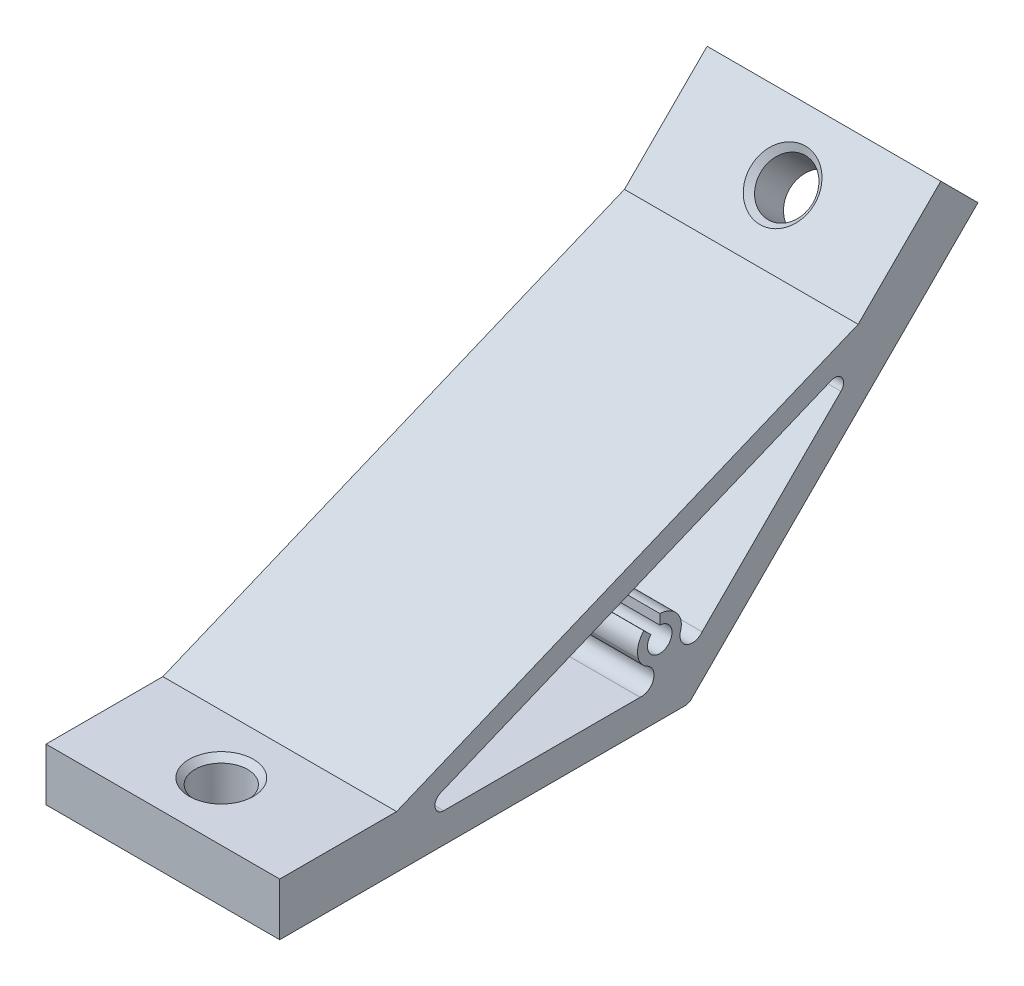
ISO-10303-21;
HEADER;
FILE_DESCRIPTION(('STEP AP214'),'2;1');
FILE_NAME('part.step','',(''),(''),'','','');
FILE_SCHEMA(('AUTOMOTIVE_DESIGN { 1 0 10303 214 1 1 1 1 }'));
ENDSEC;
DATA;
#1=APPLICATION_CONTEXT('core data for automotive mechanical design processes');
#2=APPLICATION_PROTOCOL_DEFINITION('international standard','automotive_design',2000,#1);
#3=PRODUCT_CONTEXT('',#1,'mechanical');
#4=PRODUCT('Part','Part','',(#3));
#5=PRODUCT_RELATED_PRODUCT_CATEGORY('part','',(#4));
#6=PRODUCT_DEFINITION_FORMATION('','',#4);
#7=PRODUCT_DEFINITION_CONTEXT('part definition',#1,'design');
#8=PRODUCT_DEFINITION('design','',#6,#7);
#9=PRODUCT_DEFINITION_SHAPE('','',#8);
#10=(LENGTH_UNIT() NAMED_UNIT(*) SI_UNIT(.MILLI.,.METRE.));
#11=(NAMED_UNIT(*) PLANE_ANGLE_UNIT() SI_UNIT($,.RADIAN.));
#12=(NAMED_UNIT(*) SI_UNIT($,.STERADIAN.) SOLID_ANGLE_UNIT());
#13=UNCERTAINTY_MEASURE_WITH_UNIT(LENGTH_MEASURE(1.E-05),#10,'distance_accuracy_value','');
#14=(GEOMETRIC_REPRESENTATION_CONTEXT(3) GLOBAL_UNCERTAINTY_ASSIGNED_CONTEXT((#13)) GLOBAL_UNIT_ASSIGNED_CONTEXT((#10,
#11,#12)) REPRESENTATION_CONTEXT('',''));
#15=CARTESIAN_POINT('',(0.,0.,0.));
#16=DIRECTION('',(0.,0.,1.));
#17=DIRECTION('',(1.,0.,0.));
#18=AXIS2_PLACEMENT_3D('',#15,#16,#17);
#19=CARTESIAN_POINT('',(20.,9.,70.));
#20=DIRECTION('',(0.,0.,-1.));
#21=DIRECTION('',(-1.,0.,0.));
#22=AXIS2_PLACEMENT_3D('',#19,#20,#21);
#23=PLANE('',#22);
#24=DIRECTION('',(0.,-1.,0.));
#25=VECTOR('',#24,1.);
#26=CARTESIAN_POINT('',(-20.,9.,70.));
#27=LINE('',#26,#25);
#28=CARTESIAN_POINT('',(-20.,9.,70.));
#29=VERTEX_POINT('',#28);
#30=CARTESIAN_POINT('',(-20.,0.,70.));
#31=VERTEX_POINT('',#30);
#32=EDGE_CURVE('E232',#29,#31,#27,.T.);
#33=ORIENTED_EDGE('',*,*,#32,.T.);
#34=DIRECTION('',(-1.,0.,0.));
#35=VECTOR('',#34,1.);
#36=CARTESIAN_POINT('',(20.,0.,70.));
#37=LINE('',#36,#35);
#38=CARTESIAN_POINT('',(20.,0.,70.));
#39=VERTEX_POINT('',#38);
#40=EDGE_CURVE('E286',#39,#31,#37,.T.);
#41=ORIENTED_EDGE('',*,*,#40,.F.);
#42=DIRECTION('',(0.,-1.,0.));
#43=VECTOR('',#42,1.);
#44=CARTESIAN_POINT('',(20.,9.,70.));
#45=LINE('',#44,#43);
#46=CARTESIAN_POINT('',(20.,9.,70.));
#47=VERTEX_POINT('',#46);
#48=EDGE_CURVE('E240',#47,#39,#45,.T.);
#49=ORIENTED_EDGE('',*,*,#48,.F.);
#50=DIRECTION('',(-1.,0.,0.));
#51=VECTOR('',#50,1.);
#52=CARTESIAN_POINT('',(20.,9.,70.));
#53=LINE('',#52,#51);
#54=EDGE_CURVE('E257',#47,#29,#53,.T.);
#55=ORIENTED_EDGE('',*,*,#54,.T.);
#56=EDGE_LOOP('',(#33,#41,#49,#55));
#57=FACE_BOUND('',#56,.T.);
#58=ADVANCED_FACE('F16',(#57),#23,.F.);
#59=CARTESIAN_POINT('',(20.,0.,70.));
#60=DIRECTION('',(0.,1.,0.));
#61=DIRECTION('',(0.,0.,1.));
#62=AXIS2_PLACEMENT_3D('',#59,#60,#61);
#63=PLANE('',#62);
#64=CARTESIAN_POINT('',(0.,0.,60.));
#65=DIRECTION('',(0.,1.,0.));
#66=DIRECTION('',(0.,0.,1.));
#67=AXIS2_PLACEMENT_3D('',#64,#65,#66);
#68=CIRCLE('',#67,5.50000000000003);
#69=CARTESIAN_POINT('',(0.,0.,65.5));
#70=VERTEX_POINT('',#69);
#71=EDGE_CURVE('E307',#70,#70,#68,.T.);
#72=ORIENTED_EDGE('',*,*,#71,.T.);
#73=EDGE_LOOP('',(#72));
#74=FACE_BOUND('',#73,.T.);
#75=DIRECTION('',(0.,0.,-1.));
#76=VECTOR('',#75,1.);
#77=CARTESIAN_POINT('',(-20.,0.,70.));
#78=LINE('',#77,#76);
#79=CARTESIAN_POINT('',(-20.,0.,0.621320343559648));
#80=VERTEX_POINT('',#79);
#81=EDGE_CURVE('E260',#31,#80,#78,.T.);
#82=ORIENTED_EDGE('',*,*,#81,.T.);
#83=DIRECTION('',(-1.,0.,0.));
#84=VECTOR('',#83,1.);
#85=CARTESIAN_POINT('',(20.,0.,0.621320343559648));
#86=LINE('',#85,#84);
#87=CARTESIAN_POINT('',(20.,0.,0.621320343559648));
#88=VERTEX_POINT('',#87);
#89=EDGE_CURVE('E336',#80,#88,#86,.F.);
#90=ORIENTED_EDGE('',*,*,#89,.T.);
#91=DIRECTION('',(0.,0.,-1.));
#92=VECTOR('',#91,1.);
#93=CARTESIAN_POINT('',(20.,0.,70.));
#94=LINE('',#93,#92);
#95=EDGE_CURVE('E243',#39,#88,#94,.T.);
#96=ORIENTED_EDGE('',*,*,#95,.F.);
#97=ORIENTED_EDGE('',*,*,#40,.T.);
#98=EDGE_LOOP('',(#82,#90,#96,#97));
#99=FACE_BOUND('',#98,.T.);
#100=ADVANCED_FACE('F411',(#74,#99),#63,.F.);
#101=CARTESIAN_POINT('',(20.,0.,0.));
#102=DIRECTION('',(0.,0.707106781186546,0.707106781186549));
#103=DIRECTION('',(0.,-0.707106781186549,0.707106781186546));
#104=AXIS2_PLACEMENT_3D('',#101,#102,#103);
#105=PLANE('',#104);
#106=CARTESIAN_POINT('',(0.,42.4264068711929,-42.4264068711928));
#107=DIRECTION('',(0.,0.707106781186546,0.707106781186549));
#108=DIRECTION('',(0.,-0.707106781186549,0.707106781186546));
#109=AXIS2_PLACEMENT_3D('',#106,#107,#108);
#110=CIRCLE('',#109,5.50000000000001);
#111=CARTESIAN_POINT('',(0.,38.5373195746669,-38.5373195746668));
#112=VERTEX_POINT('',#111);
#113=EDGE_CURVE('E316',#112,#112,#110,.T.);
#114=ORIENTED_EDGE('',*,*,#113,.T.);
#115=EDGE_LOOP('',(#114));
#116=FACE_BOUND('',#115,.T.);
#117=DIRECTION('',(0.,0.707106781186549,-0.707106781186546));
#118=VECTOR('',#117,1.);
#119=CARTESIAN_POINT('',(20.,0.,0.));
#120=LINE('',#119,#118);
#121=CARTESIAN_POINT('',(20.,0.43933982822018,-0.439339828220179));
#122=VERTEX_POINT('',#121);
#123=CARTESIAN_POINT('',(20.,49.4974746830584,-49.4974746830582));
#124=VERTEX_POINT('',#123);
#125=EDGE_CURVE('E247',#122,#124,#120,.T.);
#126=ORIENTED_EDGE('',*,*,#125,.F.);
#127=DIRECTION('',(-1.,0.,0.));
#128=VECTOR('',#127,1.);
#129=CARTESIAN_POINT('',(20.,0.43933982822018,-0.439339828220179));
#130=LINE('',#129,#128);
#131=CARTESIAN_POINT('',(-20.,0.43933982822018,-0.439339828220179));
#132=VERTEX_POINT('',#131);
#133=EDGE_CURVE('E331',#122,#132,#130,.T.);
#134=ORIENTED_EDGE('',*,*,#133,.T.);
#135=DIRECTION('',(0.,0.707106781186549,-0.707106781186546));
#136=VECTOR('',#135,1.);
#137=CARTESIAN_POINT('',(-20.,0.,0.));
#138=LINE('',#137,#136);
#139=CARTESIAN_POINT('',(-20.,49.4974746830584,-49.4974746830582));
#140=VERTEX_POINT('',#139);
#141=EDGE_CURVE('E263',#132,#140,#138,.T.);
#142=ORIENTED_EDGE('',*,*,#141,.T.);
#143=DIRECTION('',(-1.,0.,0.));
#144=VECTOR('',#143,1.);
#145=CARTESIAN_POINT('',(20.,49.4974746830584,-49.4974746830582));
#146=LINE('',#145,#144);
#147=EDGE_CURVE('E283',#124,#140,#146,.T.);
#148=ORIENTED_EDGE('',*,*,#147,.F.);
#149=EDGE_LOOP('',(#126,#134,#142,#148));
#150=FACE_BOUND('',#149,.T.);
#151=ADVANCED_FACE('F417',(#116,#150),#105,.F.);
#152=CARTESIAN_POINT('',(20.,49.4974746830584,-49.4974746830582));
#153=DIRECTION('',(0.,-0.707106781186549,0.707106781186546));
#154=DIRECTION('',(0.,-0.707106781186546,-0.707106781186549));
#155=AXIS2_PLACEMENT_3D('',#152,#153,#154);
#156=PLANE('',#155);
#157=DIRECTION('',(0.,0.707106781186546,0.707106781186549));
#158=VECTOR('',#157,1.);
#159=CARTESIAN_POINT('',(-20.,49.4974746830584,-49.4974746830582));
#160=LINE('',#159,#158);
#161=CARTESIAN_POINT('',(-20.,55.8614357137373,-43.1335136523793));
#162=VERTEX_POINT('',#161);
#163=EDGE_CURVE('E265',#140,#162,#160,.T.);
#164=ORIENTED_EDGE('',*,*,#163,.T.);
#165=DIRECTION('',(-1.,0.,0.));
#166=VECTOR('',#165,1.);
#167=CARTESIAN_POINT('',(20.,55.8614357137373,-43.1335136523793));
#168=LINE('',#167,#166);
#169=CARTESIAN_POINT('',(20.,55.8614357137373,-43.1335136523793));
#170=VERTEX_POINT('',#169);
#171=EDGE_CURVE('E280',#170,#162,#168,.T.);
#172=ORIENTED_EDGE('',*,*,#171,.F.);
#173=DIRECTION('',(0.,0.707106781186546,0.707106781186549));
#174=VECTOR('',#173,1.);
#175=CARTESIAN_POINT('',(20.,49.4974746830584,-49.4974746830582));
#176=LINE('',#175,#174);
#177=EDGE_CURVE('E249',#124,#170,#176,.T.);
#178=ORIENTED_EDGE('',*,*,#177,.F.);
#179=ORIENTED_EDGE('',*,*,#147,.T.);
#180=EDGE_LOOP('',(#164,#172,#178,#179));
#181=FACE_BOUND('',#180,.T.);
#182=ADVANCED_FACE('F459',(#181),#156,.F.);
#183=CARTESIAN_POINT('',(20.,55.8614357137373,-43.1335136523793));
#184=DIRECTION('',(0.,-0.707106781186546,-0.707106781186549));
#185=DIRECTION('',(0.,0.707106781186549,-0.707106781186546));
#186=AXIS2_PLACEMENT_3D('',#183,#184,#185);
#187=PLANE('',#186);
#188=CARTESIAN_POINT('',(0.,48.7903679018718,-36.0624458405138));
#189=DIRECTION('',(0.,-0.707106781186546,-0.707106781186549));
#190=DIRECTION('',(0.,0.707106781186549,-0.707106781186546));
#191=AXIS2_PLACEMENT_3D('',#188,#189,#190);
#192=CIRCLE('',#191,5.5);
#193=CARTESIAN_POINT('',(0.,52.6794551983979,-39.9515331370398));
#194=VERTEX_POINT('',#193);
#195=EDGE_CURVE('E328',#194,#194,#192,.T.);
#196=ORIENTED_EDGE('',*,*,#195,.T.);
#197=EDGE_LOOP('',(#196));
#198=FACE_BOUND('',#197,.T.);
#199=DIRECTION('',(0.,-0.707106781186549,0.707106781186546));
#200=VECTOR('',#199,1.);
#201=CARTESIAN_POINT('',(-20.,55.8614357137373,-43.1335136523793));
#202=LINE('',#201,#200);
#203=CARTESIAN_POINT('',(-20.,41.7193000900063,-28.9913780286484));
#204=VERTEX_POINT('',#203);
#205=EDGE_CURVE('E267',#162,#204,#202,.T.);
#206=ORIENTED_EDGE('',*,*,#205,.T.);
#207=DIRECTION('',(-1.,0.,0.));
#208=VECTOR('',#207,1.);
#209=CARTESIAN_POINT('',(20.,41.7193000900063,-28.9913780286484));
#210=LINE('',#209,#208);
#211=CARTESIAN_POINT('',(20.,41.7193000900063,-28.9913780286484));
#212=VERTEX_POINT('',#211);
#213=EDGE_CURVE('E277',#212,#204,#210,.T.);
#214=ORIENTED_EDGE('',*,*,#213,.F.);
#215=DIRECTION('',(0.,-0.707106781186549,0.707106781186546));
#216=VECTOR('',#215,1.);
#217=CARTESIAN_POINT('',(20.,55.8614357137373,-43.1335136523793));
#218=LINE('',#217,#216);
#219=EDGE_CURVE('E251',#170,#212,#218,.T.);
#220=ORIENTED_EDGE('',*,*,#219,.F.);
#221=ORIENTED_EDGE('',*,*,#171,.T.);
#222=EDGE_LOOP('',(#206,#214,#220,#221));
#223=FACE_BOUND('',#222,.T.);
#224=ADVANCED_FACE('F465',(#198,#223),#187,.F.);
#225=CARTESIAN_POINT('',(20.,41.7193000900063,-28.9913780286484));
#226=DIRECTION('',(0.,-0.923879532511287,-0.382683432365091));
#227=DIRECTION('',(0.,0.382683432365091,-0.923879532511287));
#228=AXIS2_PLACEMENT_3D('',#225,#226,#227);
#229=PLANE('',#228);
#230=DIRECTION('',(0.,-0.382683432365091,0.923879532511287));
#231=VECTOR('',#230,1.);
#232=CARTESIAN_POINT('',(-20.,41.7193000900063,-28.9913780286484));
#233=LINE('',#232,#231);
#234=CARTESIAN_POINT('',(-20.,9.,50.));
#235=VERTEX_POINT('',#234);
#236=EDGE_CURVE('E269',#204,#235,#233,.T.);
#237=ORIENTED_EDGE('',*,*,#236,.T.);
#238=DIRECTION('',(-1.,0.,0.));
#239=VECTOR('',#238,1.);
#240=CARTESIAN_POINT('',(20.,9.,50.));
#241=LINE('',#240,#239);
#242=CARTESIAN_POINT('',(20.,9.,50.));
#243=VERTEX_POINT('',#242);
#244=EDGE_CURVE('E274',#243,#235,#241,.T.);
#245=ORIENTED_EDGE('',*,*,#244,.F.);
#246=DIRECTION('',(0.,-0.382683432365091,0.923879532511287));
#247=VECTOR('',#246,1.);
#248=CARTESIAN_POINT('',(20.,41.7193000900063,-28.9913780286484));
#249=LINE('',#248,#247);
#250=EDGE_CURVE('E253',#212,#243,#249,.T.);
#251=ORIENTED_EDGE('',*,*,#250,.F.);
#252=ORIENTED_EDGE('',*,*,#213,.T.);
#253=EDGE_LOOP('',(#237,#245,#251,#252));
#254=FACE_BOUND('',#253,.T.);
#255=ADVANCED_FACE('F469',(#254),#229,.F.);
#256=CARTESIAN_POINT('',(20.,9.,50.));
#257=DIRECTION('',(0.,-1.,0.));
#258=DIRECTION('',(0.,0.,-1.));
#259=AXIS2_PLACEMENT_3D('',#256,#257,#258);
#260=PLANE('',#259);
#261=CARTESIAN_POINT('',(0.,9.,60.));
#262=DIRECTION('',(0.,-1.,0.));
#263=DIRECTION('',(0.,0.,-1.));
#264=AXIS2_PLACEMENT_3D('',#261,#262,#263);
#265=CIRCLE('',#264,5.49999999999999);
#266=CARTESIAN_POINT('',(0.,9.,54.5));
#267=VERTEX_POINT('',#266);
#268=EDGE_CURVE('E325',#267,#267,#265,.T.);
#269=ORIENTED_EDGE('',*,*,#268,.T.);
#270=EDGE_LOOP('',(#269));
#271=FACE_BOUND('',#270,.T.);
#272=DIRECTION('',(0.,0.,1.));
#273=VECTOR('',#272,1.);
#274=CARTESIAN_POINT('',(-20.,9.,50.));
#275=LINE('',#274,#273);
#276=EDGE_CURVE('E244',#235,#29,#275,.T.);
#277=ORIENTED_EDGE('',*,*,#276,.T.);
#278=ORIENTED_EDGE('',*,*,#54,.F.);
#279=DIRECTION('',(0.,0.,1.));
#280=VECTOR('',#279,1.);
#281=CARTESIAN_POINT('',(20.,9.,50.));
#282=LINE('',#281,#280);
#283=EDGE_CURVE('E255',#243,#47,#282,.T.);
#284=ORIENTED_EDGE('',*,*,#283,.F.);
#285=ORIENTED_EDGE('',*,*,#244,.T.);
#286=EDGE_LOOP('',(#277,#278,#284,#285));
#287=FACE_BOUND('',#286,.T.);
#288=ADVANCED_FACE('F474',(#271,#287),#260,.F.);
#289=CARTESIAN_POINT('',(20.,0.,0.));
#290=DIRECTION('',(1.,0.,0.));
#291=DIRECTION('',(0.,0.,-1.));
#292=AXIS2_PLACEMENT_3D('',#289,#290,#291);
#293=PLANE('',#292);
#294=CARTESIAN_POINT('',(20.,10.8154070502541,-0.615215798921915));
#295=DIRECTION('',(1.,0.,0.));
#296=DIRECTION('',(0.,0.,-1.));
#297=AXIS2_PLACEMENT_3D('',#294,#295,#296);
#298=CIRCLE('',#297,2.12778789665589);
#299=CARTESIAN_POINT('',(20.,11.4653478220074,1.41087855385834));
#300=VERTEX_POINT('',#299);
#301=CARTESIAN_POINT('',(20.,9.50085947219855,-2.28837030409573));
#302=VERTEX_POINT('',#301);
#303=EDGE_CURVE('E223',#300,#302,#298,.T.);
#304=ORIENTED_EDGE('',*,*,#303,.F.);
#305=CARTESIAN_POINT('',(20.,12.3817090431255,4.26749930440101));
#306=DIRECTION('',(1.,0.,0.));
#307=DIRECTION('',(0.,0.,-1.));
#308=AXIS2_PLACEMENT_3D('',#305,#306,#307);
#309=CIRCLE('',#308,3.);
#310=CARTESIAN_POINT('',(20.,13.8131179548462,1.63101138911547));
#311=VERTEX_POINT('',#310);
#312=EDGE_CURVE('E345',#300,#311,#309,.T.);
#313=ORIENTED_EDGE('',*,*,#312,.T.);
#314=CARTESIAN_POINT('',(20.,12.,4.97056274847716));
#315=DIRECTION('',(-1.,0.,0.));
#316=DIRECTION('',(0.,0.,-1.));
#317=AXIS2_PLACEMENT_3D('',#314,#315,#316);
#318=CIRCLE('',#317,3.8);
#319=CARTESIAN_POINT('',(20.,15.7996748244009,4.92085129291301));
#320=VERTEX_POINT('',#319);
#321=EDGE_CURVE('E220',#320,#311,#318,.T.);
#322=ORIENTED_EDGE('',*,*,#321,.F.);
#323=DIRECTION('',(0.,0.99991442747391,-0.0130819619905629));
#324=VECTOR('',#323,1.);
#325=CARTESIAN_POINT('',(20.,15.7996748244009,4.92085129291301));
#326=LINE('',#325,#324);
#327=CARTESIAN_POINT('',(20.,14.0998202976952,4.94309062829697));
#328=VERTEX_POINT('',#327);
#329=EDGE_CURVE('E217',#328,#320,#326,.T.);
#330=ORIENTED_EDGE('',*,*,#329,.F.);
#331=CARTESIAN_POINT('',(20.,12.,4.97056274847716));
#332=DIRECTION('',(1.,0.,0.));
#333=DIRECTION('',(0.,0.,-1.));
#334=AXIS2_PLACEMENT_3D('',#331,#332,#333);
#335=CIRCLE('',#334,2.1);
#336=CARTESIAN_POINT('',(20.,13.4653714493005,6.47478564272358));
#337=VERTEX_POINT('',#336);
#338=EDGE_CURVE('E214',#337,#328,#335,.T.);
#339=ORIENTED_EDGE('',*,*,#338,.F.);
#340=DIRECTION('',(0.,-0.697795928238311,-0.716296616307821));
#341=VECTOR('',#340,1.);
#342=CARTESIAN_POINT('',(20.,14.6516245273056,7.69248989044687));
#343=LINE('',#342,#341);
#344=CARTESIAN_POINT('',(20.,14.6516245273056,7.69248989044687));
#345=VERTEX_POINT('',#344);
#346=EDGE_CURVE('E212',#345,#337,#343,.T.);
#347=ORIENTED_EDGE('',*,*,#346,.F.);
#348=CARTESIAN_POINT('',(20.,12.,4.97056274847716));
#349=DIRECTION('',(-1.,0.,0.));
#350=DIRECTION('',(0.,0.,-1.));
#351=AXIS2_PLACEMENT_3D('',#348,#349,#350);
#352=CIRCLE('',#351,3.8);
#353=CARTESIAN_POINT('',(20.,10.9206485886374,8.61405016176536));
#354=VERTEX_POINT('',#353);
#355=EDGE_CURVE('E180',#354,#345,#352,.T.);
#356=ORIENTED_EDGE('',*,*,#355,.F.);
#357=CARTESIAN_POINT('',(20.,11.7727681239237,5.73761273022204));
#358=DIRECTION('',(1.,0.,0.));
#359=DIRECTION('',(0.,0.,-1.));
#360=AXIS2_PLACEMENT_3D('',#357,#358,#359);
#361=CIRCLE('',#360,3.);
#362=CARTESIAN_POINT('',(20.,9.10486698646775,7.10958340073999));
#363=VERTEX_POINT('',#362);
#364=EDGE_CURVE('E343',#354,#363,#361,.T.);
#365=ORIENTED_EDGE('',*,*,#364,.T.);
#366=CARTESIAN_POINT('',(20.,7.2126244032167,8.0826709298383));
#367=DIRECTION('',(1.,0.,0.));
#368=DIRECTION('',(0.,0.,1.));
#369=AXIS2_PLACEMENT_3D('',#366,#367,#368);
#370=CIRCLE('',#369,2.12778789665589);
#371=CARTESIAN_POINT('',(20.,5.1,8.33624431978406));
#372=VERTEX_POINT('',#371);
#373=EDGE_CURVE('E209',#372,#363,#370,.T.);
#374=ORIENTED_EDGE('',*,*,#373,.F.);
#375=DIRECTION('',(0.,0.,-1.));
#376=VECTOR('',#375,1.);
#377=CARTESIAN_POINT('',(20.,5.10000000000001,49.4855543601946));
#378=LINE('',#377,#376);
#379=CARTESIAN_POINT('',(20.,5.10000000000001,41.9445451220059));
#380=VERTEX_POINT('',#379);
#381=EDGE_CURVE('E207',#380,#372,#378,.T.);
#382=ORIENTED_EDGE('',*,*,#381,.F.);
#383=CARTESIAN_POINT('',(20.,6.60000000000001,41.9445451220059));
#384=DIRECTION('',(1.,0.,0.));
#385=DIRECTION('',(0.,0.,-1.));
#386=AXIS2_PLACEMENT_3D('',#383,#384,#385);
#387=CIRCLE('',#386,1.5);
#388=CARTESIAN_POINT('',(20.,7.98581929876694,42.5185702705535));
#389=VERTEX_POINT('',#388);
#390=EDGE_CURVE('E303',#380,#389,#387,.F.);
#391=ORIENTED_EDGE('',*,*,#390,.T.);
#392=DIRECTION('',(0.,-0.38268343236509,0.923879532511287));
#393=VECTOR('',#392,1.);
#394=CARTESIAN_POINT('',(20.,38.5978156429206,-31.3853264748177));
#395=LINE('',#394,#393);
#396=CARTESIAN_POINT('',(20.,35.7119963441536,-24.4183423851765));
#397=VERTEX_POINT('',#396);
#398=EDGE_CURVE('E204',#397,#389,#395,.T.);
#399=ORIENTED_EDGE('',*,*,#398,.F.);
#400=CARTESIAN_POINT('',(20.,34.3261770453867,-24.9923675337242));
#401=DIRECTION('',(1.,0.,0.));
#402=DIRECTION('',(0.,0.,-1.));
#403=AXIS2_PLACEMENT_3D('',#400,#401,#402);
#404=CIRCLE('',#403,1.5);
#405=CARTESIAN_POINT('',(20.,33.2655168736069,-26.053027705504));
#406=VERTEX_POINT('',#405);
#407=EDGE_CURVE('E299',#397,#406,#404,.F.);
#408=ORIENTED_EDGE('',*,*,#407,.T.);
#409=DIRECTION('',(0.,0.707106781186549,-0.707106781186546));
#410=VECTOR('',#409,1.);
#411=CARTESIAN_POINT('',(20.,9.50085947219855,-2.28837030409573));
#412=LINE('',#411,#410);
#413=EDGE_CURVE('E225',#302,#406,#412,.T.);
#414=ORIENTED_EDGE('',*,*,#413,.F.);
#415=EDGE_LOOP('',(#304,#313,#322,#330,#339,#347,#356,#365,#374,#382,#391,#399,#408,#414));
#416=FACE_BOUND('',#415,.T.);
#417=ORIENTED_EDGE('',*,*,#95,.T.);
#418=CARTESIAN_POINT('',(20.,1.5,0.621320343559645));
#419=DIRECTION('',(1.,0.,0.));
#420=DIRECTION('',(0.,0.,-1.));
#421=AXIS2_PLACEMENT_3D('',#418,#419,#420);
#422=CIRCLE('',#421,1.5);
#423=EDGE_CURVE('E338',#88,#122,#422,.T.);
#424=ORIENTED_EDGE('',*,*,#423,.T.);
#425=ORIENTED_EDGE('',*,*,#125,.T.);
#426=ORIENTED_EDGE('',*,*,#177,.T.);
#427=ORIENTED_EDGE('',*,*,#219,.T.);
#428=ORIENTED_EDGE('',*,*,#250,.T.);
#429=ORIENTED_EDGE('',*,*,#283,.T.);
#430=ORIENTED_EDGE('',*,*,#48,.T.);
#431=EDGE_LOOP('',(#417,#424,#425,#426,#427,#428,#429,#430));
#432=FACE_BOUND('',#431,.T.);
#433=ADVANCED_FACE('F354',(#416,#432),#293,.T.);
#434=CARTESIAN_POINT('',(-20.,0.,0.));
#435=DIRECTION('',(1.,0.,0.));
#436=DIRECTION('',(0.,0.,-1.));
#437=AXIS2_PLACEMENT_3D('',#434,#435,#436);
#438=PLANE('',#437);
#439=CARTESIAN_POINT('',(-20.,12.,4.97056274847716));
#440=DIRECTION('',(-1.,0.,0.));
#441=DIRECTION('',(0.,0.,-1.));
#442=AXIS2_PLACEMENT_3D('',#439,#440,#441);
#443=CIRCLE('',#442,3.8);
#444=CARTESIAN_POINT('',(-20.,15.7996748244009,4.92085129291301));
#445=VERTEX_POINT('',#444);
#446=CARTESIAN_POINT('',(-20.,13.8131179548462,1.63101138911547));
#447=VERTEX_POINT('',#446);
#448=EDGE_CURVE('E197',#445,#447,#443,.T.);
#449=ORIENTED_EDGE('',*,*,#448,.T.);
#450=CARTESIAN_POINT('',(-20.,12.3817090431255,4.26749930440101));
#451=DIRECTION('',(1.,0.,0.));
#452=DIRECTION('',(0.,0.,-1.));
#453=AXIS2_PLACEMENT_3D('',#450,#451,#452);
#454=CIRCLE('',#453,3.);
#455=CARTESIAN_POINT('',(-20.,11.4653478220074,1.41087855385834));
#456=VERTEX_POINT('',#455);
#457=EDGE_CURVE('E350',#447,#456,#454,.F.);
#458=ORIENTED_EDGE('',*,*,#457,.T.);
#459=CARTESIAN_POINT('',(-20.,10.8154070502541,-0.615215798921915));
#460=DIRECTION('',(1.,0.,0.));
#461=DIRECTION('',(0.,0.,-1.));
#462=AXIS2_PLACEMENT_3D('',#459,#460,#461);
#463=CIRCLE('',#462,2.12778789665589);
#464=CARTESIAN_POINT('',(-20.,9.50085947219855,-2.28837030409573));
#465=VERTEX_POINT('',#464);
#466=EDGE_CURVE('E199',#456,#465,#463,.T.);
#467=ORIENTED_EDGE('',*,*,#466,.T.);
#468=DIRECTION('',(0.,0.707106781186549,-0.707106781186546));
#469=VECTOR('',#468,1.);
#470=CARTESIAN_POINT('',(-20.,9.50085947219855,-2.28837030409573));
#471=LINE('',#470,#469);
#472=CARTESIAN_POINT('',(-20.,33.2655168736069,-26.053027705504));
#473=VERTEX_POINT('',#472);
#474=EDGE_CURVE('E201',#465,#473,#471,.T.);
#475=ORIENTED_EDGE('',*,*,#474,.T.);
#476=CARTESIAN_POINT('',(-20.,34.3261770453867,-24.9923675337242));
#477=DIRECTION('',(1.,0.,0.));
#478=DIRECTION('',(0.,0.,-1.));
#479=AXIS2_PLACEMENT_3D('',#476,#477,#478);
#480=CIRCLE('',#479,1.5);
#481=CARTESIAN_POINT('',(-20.,35.7119963441536,-24.4183423851765));
#482=VERTEX_POINT('',#481);
#483=EDGE_CURVE('E301',#473,#482,#480,.T.);
#484=ORIENTED_EDGE('',*,*,#483,.T.);
#485=DIRECTION('',(0.,-0.38268343236509,0.923879532511287));
#486=VECTOR('',#485,1.);
#487=CARTESIAN_POINT('',(-20.,38.5978156429206,-31.3853264748177));
#488=LINE('',#487,#486);
#489=CARTESIAN_POINT('',(-20.,7.98581929876694,42.5185702705535));
#490=VERTEX_POINT('',#489);
#491=EDGE_CURVE('E228',#482,#490,#488,.T.);
#492=ORIENTED_EDGE('',*,*,#491,.T.);
#493=CARTESIAN_POINT('',(-20.,6.60000000000001,41.9445451220059));
#494=DIRECTION('',(1.,0.,0.));
#495=DIRECTION('',(0.,0.,-1.));
#496=AXIS2_PLACEMENT_3D('',#493,#494,#495);
#497=CIRCLE('',#496,1.5);
#498=CARTESIAN_POINT('',(-20.,5.10000000000001,41.9445451220059));
#499=VERTEX_POINT('',#498);
#500=EDGE_CURVE('E305',#490,#499,#497,.T.);
#501=ORIENTED_EDGE('',*,*,#500,.T.);
#502=DIRECTION('',(0.,0.,-1.));
#503=VECTOR('',#502,1.);
#504=CARTESIAN_POINT('',(-20.,5.10000000000001,49.4855543601946));
#505=LINE('',#504,#503);
#506=CARTESIAN_POINT('',(-20.,5.1,8.33624431978406));
#507=VERTEX_POINT('',#506);
#508=EDGE_CURVE('E401',#499,#507,#505,.T.);
#509=ORIENTED_EDGE('',*,*,#508,.T.);
#510=CARTESIAN_POINT('',(-20.,7.2126244032167,8.0826709298383));
#511=DIRECTION('',(1.,0.,0.));
#512=DIRECTION('',(0.,0.,1.));
#513=AXIS2_PLACEMENT_3D('',#510,#511,#512);
#514=CIRCLE('',#513,2.12778789665589);
#515=CARTESIAN_POINT('',(-20.,9.10486698646775,7.10958340073999));
#516=VERTEX_POINT('',#515);
#517=EDGE_CURVE('E174',#507,#516,#514,.T.);
#518=ORIENTED_EDGE('',*,*,#517,.T.);
#519=CARTESIAN_POINT('',(-20.,11.7727681239237,5.73761273022204));
#520=DIRECTION('',(1.,0.,0.));
#521=DIRECTION('',(0.,0.,-1.));
#522=AXIS2_PLACEMENT_3D('',#519,#520,#521);
#523=CIRCLE('',#522,3.);
#524=CARTESIAN_POINT('',(-20.,10.9206485886374,8.61405016176536));
#525=VERTEX_POINT('',#524);
#526=EDGE_CURVE('E31',#516,#525,#523,.F.);
#527=ORIENTED_EDGE('',*,*,#526,.T.);
#528=CARTESIAN_POINT('',(-20.,12.,4.97056274847716));
#529=DIRECTION('',(-1.,0.,0.));
#530=DIRECTION('',(0.,0.,-1.));
#531=AXIS2_PLACEMENT_3D('',#528,#529,#530);
#532=CIRCLE('',#531,3.8);
#533=CARTESIAN_POINT('',(-20.,14.6516245273056,7.69248989044687));
#534=VERTEX_POINT('',#533);
#535=EDGE_CURVE('E163',#525,#534,#532,.T.);
#536=ORIENTED_EDGE('',*,*,#535,.T.);
#537=DIRECTION('',(0.,-0.697795928238311,-0.716296616307821));
#538=VECTOR('',#537,1.);
#539=CARTESIAN_POINT('',(-20.,14.6516245273056,7.69248989044687));
#540=LINE('',#539,#538);
#541=CARTESIAN_POINT('',(-20.,13.4653714493005,6.47478564272358));
#542=VERTEX_POINT('',#541);
#543=EDGE_CURVE('E170',#534,#542,#540,.T.);
#544=ORIENTED_EDGE('',*,*,#543,.T.);
#545=CARTESIAN_POINT('',(-20.,12.,4.97056274847716));
#546=DIRECTION('',(1.,0.,0.));
#547=DIRECTION('',(0.,0.,-1.));
#548=AXIS2_PLACEMENT_3D('',#545,#546,#547);
#549=CIRCLE('',#548,2.1);
#550=CARTESIAN_POINT('',(-20.,14.0998202976952,4.94309062829697));
#551=VERTEX_POINT('',#550);
#552=EDGE_CURVE('E189',#542,#551,#549,.T.);
#553=ORIENTED_EDGE('',*,*,#552,.T.);
#554=DIRECTION('',(0.,0.99991442747391,-0.0130819619905629));
#555=VECTOR('',#554,1.);
#556=CARTESIAN_POINT('',(-20.,15.7996748244009,4.92085129291301));
#557=LINE('',#556,#555);
#558=EDGE_CURVE('E191',#551,#445,#557,.T.);
#559=ORIENTED_EDGE('',*,*,#558,.T.);
#560=EDGE_LOOP('',(#449,#458,#467,#475,#484,#492,#501,#509,#518,#527,#536,#544,#553,#559));
#561=FACE_BOUND('',#560,.T.);
#562=ORIENTED_EDGE('',*,*,#141,.F.);
#563=CARTESIAN_POINT('',(-20.,1.5,0.621320343559645));
#564=DIRECTION('',(1.,0.,0.));
#565=DIRECTION('',(0.,0.,-1.));
#566=AXIS2_PLACEMENT_3D('',#563,#564,#565);
#567=CIRCLE('',#566,1.5);
#568=EDGE_CURVE('E334',#132,#80,#567,.F.);
#569=ORIENTED_EDGE('',*,*,#568,.T.);
#570=ORIENTED_EDGE('',*,*,#81,.F.);
#571=ORIENTED_EDGE('',*,*,#32,.F.);
#572=ORIENTED_EDGE('',*,*,#276,.F.);
#573=ORIENTED_EDGE('',*,*,#236,.F.);
#574=ORIENTED_EDGE('',*,*,#205,.F.);
#575=ORIENTED_EDGE('',*,*,#163,.F.);
#576=EDGE_LOOP('',(#562,#569,#570,#571,#572,#573,#574,#575));
#577=FACE_BOUND('',#576,.T.);
#578=ADVANCED_FACE('F166',(#561,#577),#438,.F.);
#579=CARTESIAN_POINT('',(-20.,38.5978156429206,-31.3853264748177));
#580=DIRECTION('',(0.,0.923879532511287,0.38268343236509));
#581=DIRECTION('',(0.,-0.38268343236509,0.923879532511287));
#582=AXIS2_PLACEMENT_3D('',#579,#580,#581);
#583=PLANE('',#582);
#584=ORIENTED_EDGE('',*,*,#491,.F.);
#585=DIRECTION('',(1.,0.,0.));
#586=VECTOR('',#585,1.);
#587=CARTESIAN_POINT('',(20.,35.7119963441536,-24.4183423851765));
#588=LINE('',#587,#586);
#589=EDGE_CURVE('E291',#482,#397,#588,.T.);
#590=ORIENTED_EDGE('',*,*,#589,.T.);
#591=ORIENTED_EDGE('',*,*,#398,.T.);
#592=DIRECTION('',(1.,0.,0.));
#593=VECTOR('',#592,1.);
#594=CARTESIAN_POINT('',(-20.,7.98581929876695,42.5185702705535));
#595=LINE('',#594,#593);
#596=EDGE_CURVE('E289',#389,#490,#595,.F.);
#597=ORIENTED_EDGE('',*,*,#596,.T.);
#598=EDGE_LOOP('',(#584,#590,#591,#597));
#599=FACE_BOUND('',#598,.T.);
#600=ADVANCED_FACE('F390',(#599),#583,.F.);
#601=CARTESIAN_POINT('',(-20.,9.50085947219855,-2.28837030409573));
#602=DIRECTION('',(0.,-0.707106781186546,-0.707106781186549));
#603=DIRECTION('',(0.,0.707106781186549,-0.707106781186546));
#604=AXIS2_PLACEMENT_3D('',#601,#602,#603);
#605=PLANE('',#604);
#606=ORIENTED_EDGE('',*,*,#413,.T.);
#607=DIRECTION('',(1.,0.,0.));
#608=VECTOR('',#607,1.);
#609=CARTESIAN_POINT('',(-20.,33.2655168736069,-26.053027705504));
#610=LINE('',#609,#608);
#611=EDGE_CURVE('E294',#406,#473,#610,.F.);
#612=ORIENTED_EDGE('',*,*,#611,.T.);
#613=ORIENTED_EDGE('',*,*,#474,.F.);
#614=DIRECTION('',(1.,0.,0.));
#615=VECTOR('',#614,1.);
#616=CARTESIAN_POINT('',(-20.,9.50085947219855,-2.28837030409573));
#617=LINE('',#616,#615);
#618=EDGE_CURVE('E229',#465,#302,#617,.T.);
#619=ORIENTED_EDGE('',*,*,#618,.T.);
#620=EDGE_LOOP('',(#606,#612,#613,#619));
#621=FACE_BOUND('',#620,.T.);
#622=ADVANCED_FACE('F380',(#621),#605,.F.);
#623=CARTESIAN_POINT('',(-20.,10.8154070502541,-0.615215798921915));
#624=DIRECTION('',(1.,0.,0.));
#625=DIRECTION('',(0.,0.,-1.));
#626=AXIS2_PLACEMENT_3D('',#623,#624,#625);
#627=CYLINDRICAL_SURFACE('',#626,2.12778789665589);
#628=ORIENTED_EDGE('',*,*,#466,.F.);
#629=DIRECTION('',(1.,0.,0.));
#630=VECTOR('',#629,1.);
#631=CARTESIAN_POINT('',(-20.,11.4653478220074,1.41087855385834));
#632=LINE('',#631,#630);
#633=EDGE_CURVE('E340',#456,#300,#632,.T.);
#634=ORIENTED_EDGE('',*,*,#633,.T.);
#635=ORIENTED_EDGE('',*,*,#303,.T.);
#636=ORIENTED_EDGE('',*,*,#618,.F.);
#637=EDGE_LOOP('',(#628,#634,#635,#636));
#638=FACE_BOUND('',#637,.T.);
#639=ADVANCED_FACE('F376',(#638),#627,.F.);
#640=CARTESIAN_POINT('',(-20.,12.,4.97056274847716));
#641=DIRECTION('',(1.,0.,0.));
#642=DIRECTION('',(0.,0.,-1.));
#643=AXIS2_PLACEMENT_3D('',#640,#641,#642);
#644=CYLINDRICAL_SURFACE('',#643,3.8);
#645=ORIENTED_EDGE('',*,*,#321,.T.);
#646=DIRECTION('',(1.,0.,0.));
#647=VECTOR('',#646,1.);
#648=CARTESIAN_POINT('',(-20.,13.8131179548462,1.63101138911546));
#649=LINE('',#648,#647);
#650=EDGE_CURVE('E347',#311,#447,#649,.F.);
#651=ORIENTED_EDGE('',*,*,#650,.T.);
#652=ORIENTED_EDGE('',*,*,#448,.F.);
#653=DIRECTION('',(1.,0.,0.));
#654=VECTOR('',#653,1.);
#655=CARTESIAN_POINT('',(-20.,15.7996748244009,4.92085129291301));
#656=LINE('',#655,#654);
#657=EDGE_CURVE('E233',#445,#320,#656,.T.);
#658=ORIENTED_EDGE('',*,*,#657,.T.);
#659=EDGE_LOOP('',(#645,#651,#652,#658));
#660=FACE_BOUND('',#659,.T.);
#661=ADVANCED_FACE('F368',(#660),#644,.T.);
#662=CARTESIAN_POINT('',(-20.,15.7996748244009,4.92085129291301));
#663=DIRECTION('',(0.,-0.0130819619905629,-0.99991442747391));
#664=DIRECTION('',(0.,0.99991442747391,-0.0130819619905629));
#665=AXIS2_PLACEMENT_3D('',#662,#663,#664);
#666=PLANE('',#665);
#667=ORIENTED_EDGE('',*,*,#329,.T.);
#668=ORIENTED_EDGE('',*,*,#657,.F.);
#669=ORIENTED_EDGE('',*,*,#558,.F.);
#670=DIRECTION('',(1.,0.,0.));
#671=VECTOR('',#670,1.);
#672=CARTESIAN_POINT('',(-20.,14.0998202976952,4.94309062829697));
#673=LINE('',#672,#671);
#674=EDGE_CURVE('E235',#551,#328,#673,.T.);
#675=ORIENTED_EDGE('',*,*,#674,.T.);
#676=EDGE_LOOP('',(#667,#668,#669,#675));
#677=FACE_BOUND('',#676,.T.);
#678=ADVANCED_FACE('F366',(#677),#666,.F.);
#679=CARTESIAN_POINT('',(-20.,12.,4.97056274847716));
#680=DIRECTION('',(1.,0.,0.));
#681=DIRECTION('',(0.,0.,-1.));
#682=AXIS2_PLACEMENT_3D('',#679,#680,#681);
#683=CYLINDRICAL_SURFACE('',#682,2.1);
#684=ORIENTED_EDGE('',*,*,#338,.T.);
#685=ORIENTED_EDGE('',*,*,#674,.F.);
#686=ORIENTED_EDGE('',*,*,#552,.F.);
#687=DIRECTION('',(1.,0.,0.));
#688=VECTOR('',#687,1.);
#689=CARTESIAN_POINT('',(-20.,13.4653714493005,6.47478564272358));
#690=LINE('',#689,#688);
#691=EDGE_CURVE('E184',#542,#337,#690,.T.);
#692=ORIENTED_EDGE('',*,*,#691,.T.);
#693=EDGE_LOOP('',(#684,#685,#686,#692));
#694=FACE_BOUND('',#693,.T.);
#695=ADVANCED_FACE('F361',(#694),#683,.F.);
#696=CARTESIAN_POINT('',(-20.,14.6516245273056,7.69248989044687));
#697=DIRECTION('',(0.,-0.716296616307821,0.697795928238311));
#698=DIRECTION('',(0.,-0.697795928238311,-0.716296616307821));
#699=AXIS2_PLACEMENT_3D('',#696,#697,#698);
#700=PLANE('',#699);
#701=ORIENTED_EDGE('',*,*,#346,.T.);
#702=ORIENTED_EDGE('',*,*,#691,.F.);
#703=ORIENTED_EDGE('',*,*,#543,.F.);
#704=DIRECTION('',(1.,0.,0.));
#705=VECTOR('',#704,1.);
#706=CARTESIAN_POINT('',(-20.,14.6516245273056,7.69248989044687));
#707=LINE('',#706,#705);
#708=EDGE_CURVE('E177',#534,#345,#707,.T.);
#709=ORIENTED_EDGE('',*,*,#708,.T.);
#710=EDGE_LOOP('',(#701,#702,#703,#709));
#711=FACE_BOUND('',#710,.T.);
#712=ADVANCED_FACE('F187',(#711),#700,.F.);
#713=CARTESIAN_POINT('',(-20.,12.,4.97056274847716));
#714=DIRECTION('',(1.,0.,0.));
#715=DIRECTION('',(0.,0.,-1.));
#716=AXIS2_PLACEMENT_3D('',#713,#714,#715);
#717=CYLINDRICAL_SURFACE('',#716,3.8);
#718=ORIENTED_EDGE('',*,*,#535,.F.);
#719=DIRECTION('',(1.,0.,0.));
#720=VECTOR('',#719,1.);
#721=CARTESIAN_POINT('',(-20.,10.9206485886374,8.61405016176536));
#722=LINE('',#721,#720);
#723=EDGE_CURVE('E24',#525,#354,#722,.T.);
#724=ORIENTED_EDGE('',*,*,#723,.T.);
#725=ORIENTED_EDGE('',*,*,#355,.T.);
#726=ORIENTED_EDGE('',*,*,#708,.F.);
#727=EDGE_LOOP('',(#718,#724,#725,#726));
#728=FACE_BOUND('',#727,.T.);
#729=ADVANCED_FACE('F178',(#728),#717,.T.);
#730=CARTESIAN_POINT('',(-20.,7.2126244032167,8.0826709298383));
#731=DIRECTION('',(1.,0.,0.));
#732=DIRECTION('',(0.,0.,-1.));
#733=AXIS2_PLACEMENT_3D('',#730,#731,#732);
#734=CYLINDRICAL_SURFACE('',#733,2.12778789665589);
#735=ORIENTED_EDGE('',*,*,#373,.T.);
#736=DIRECTION('',(1.,0.,0.));
#737=VECTOR('',#736,1.);
#738=CARTESIAN_POINT('',(-20.,9.10486698646775,7.10958340073999));
#739=LINE('',#738,#737);
#740=EDGE_CURVE('E10',#363,#516,#739,.F.);
#741=ORIENTED_EDGE('',*,*,#740,.T.);
#742=ORIENTED_EDGE('',*,*,#517,.F.);
#743=DIRECTION('',(1.,0.,0.));
#744=VECTOR('',#743,1.);
#745=CARTESIAN_POINT('',(-20.,5.1,8.33624431978406));
#746=LINE('',#745,#744);
#747=EDGE_CURVE('E185',#507,#372,#746,.T.);
#748=ORIENTED_EDGE('',*,*,#747,.T.);
#749=EDGE_LOOP('',(#735,#741,#742,#748));
#750=FACE_BOUND('',#749,.T.);
#751=ADVANCED_FACE('F607',(#750),#734,.F.);
#752=CARTESIAN_POINT('',(-20.,5.10000000000001,49.4855543601946));
#753=DIRECTION('',(0.,-1.,0.));
#754=DIRECTION('',(0.,0.,-1.));
#755=AXIS2_PLACEMENT_3D('',#752,#753,#754);
#756=PLANE('',#755);
#757=ORIENTED_EDGE('',*,*,#508,.F.);
#758=DIRECTION('',(1.,0.,0.));
#759=VECTOR('',#758,1.);
#760=CARTESIAN_POINT('',(20.,5.10000000000001,41.9445451220059));
#761=LINE('',#760,#759);
#762=EDGE_CURVE('E296',#499,#380,#761,.T.);
#763=ORIENTED_EDGE('',*,*,#762,.T.);
#764=ORIENTED_EDGE('',*,*,#381,.T.);
#765=ORIENTED_EDGE('',*,*,#747,.F.);
#766=EDGE_LOOP('',(#757,#763,#764,#765));
#767=FACE_BOUND('',#766,.T.);
#768=ADVANCED_FACE('F399',(#767),#756,.F.);
#769=CARTESIAN_POINT('',(-20.,34.3261770453867,-24.9923675337242));
#770=DIRECTION('',(-1.,0.,0.));
#771=DIRECTION('',(0.,0.,1.));
#772=AXIS2_PLACEMENT_3D('',#769,#770,#771);
#773=CYLINDRICAL_SURFACE('',#772,1.5);
#774=ORIENTED_EDGE('',*,*,#483,.F.);
#775=ORIENTED_EDGE('',*,*,#611,.F.);
#776=ORIENTED_EDGE('',*,*,#407,.F.);
#777=ORIENTED_EDGE('',*,*,#589,.F.);
#778=EDGE_LOOP('',(#774,#775,#776,#777));
#779=FACE_BOUND('',#778,.T.);
#780=ADVANCED_FACE('F387',(#779),#773,.F.);
#781=CARTESIAN_POINT('',(-20.,6.60000000000001,41.9445451220059));
#782=DIRECTION('',(-1.,0.,0.));
#783=DIRECTION('',(0.,0.,1.));
#784=AXIS2_PLACEMENT_3D('',#781,#782,#783);
#785=CYLINDRICAL_SURFACE('',#784,1.5);
#786=ORIENTED_EDGE('',*,*,#500,.F.);
#787=ORIENTED_EDGE('',*,*,#596,.F.);
#788=ORIENTED_EDGE('',*,*,#390,.F.);
#789=ORIENTED_EDGE('',*,*,#762,.F.);
#790=EDGE_LOOP('',(#786,#787,#788,#789));
#791=FACE_BOUND('',#790,.T.);
#792=ADVANCED_FACE('F396',(#791),#785,.F.);
#793=CARTESIAN_POINT('',(0.,17.6776695296638,-67.175144212722));
#794=DIRECTION('',(0.,0.707106781186546,0.707106781186549));
#795=DIRECTION('',(0.,-0.707106781186549,0.707106781186546));
#796=AXIS2_PLACEMENT_3D('',#793,#794,#795);
#797=CYLINDRICAL_SURFACE('',#796,4.5);
#798=CARTESIAN_POINT('',(0.,43.1335136523795,-41.7193000900062));
#799=DIRECTION('',(0.,0.707106781186548,0.707106781186548));
#800=DIRECTION('',(0.,-0.707106781186548,0.707106781186548));
#801=AXIS2_PLACEMENT_3D('',#798,#799,#800);
#802=CIRCLE('',#801,4.5);
#803=CARTESIAN_POINT('',(0.,39.95153313704,-38.5373195746668));
#804=VERTEX_POINT('',#803);
#805=EDGE_CURVE('E322',#804,#804,#802,.F.);
#806=ORIENTED_EDGE('',*,*,#805,.T.);
#807=EDGE_LOOP('',(#806));
#808=FACE_BOUND('',#807,.T.);
#809=CARTESIAN_POINT('',(0.,48.0832611206853,-36.7695526217004));
#810=DIRECTION('',(0.,-0.707106781186544,-0.707106781186551));
#811=DIRECTION('',(0.,0.707106781186551,-0.707106781186544));
#812=AXIS2_PLACEMENT_3D('',#809,#810,#811);
#813=CIRCLE('',#812,4.5);
#814=CARTESIAN_POINT('',(0.,51.2652416360248,-39.9515331370398));
#815=VERTEX_POINT('',#814);
#816=EDGE_CURVE('E319',#815,#815,#813,.F.);
#817=ORIENTED_EDGE('',*,*,#816,.T.);
#818=EDGE_LOOP('',(#817));
#819=FACE_BOUND('',#818,.T.);
#820=ADVANCED_FACE('F426',(#808,#819),#797,.F.);
#821=CARTESIAN_POINT('',(0.,0.,60.));
#822=DIRECTION('',(0.,1.,0.));
#823=DIRECTION('',(0.,0.,1.));
#824=AXIS2_PLACEMENT_3D('',#821,#822,#823);
#825=CYLINDRICAL_SURFACE('',#824,4.5);
#826=CARTESIAN_POINT('',(0.,1.00000000000004,60.));
#827=DIRECTION('',(0.,1.,0.));
#828=DIRECTION('',(0.,0.,1.));
#829=AXIS2_PLACEMENT_3D('',#826,#827,#828);
#830=CIRCLE('',#829,4.5);
#831=CARTESIAN_POINT('',(0.,1.00000000000004,64.5));
#832=VERTEX_POINT('',#831);
#833=EDGE_CURVE('E313',#832,#832,#830,.F.);
#834=ORIENTED_EDGE('',*,*,#833,.T.);
#835=EDGE_LOOP('',(#834));
#836=FACE_BOUND('',#835,.T.);
#837=CARTESIAN_POINT('',(0.,8.00000000000001,60.));
#838=DIRECTION('',(0.,-1.,0.));
#839=DIRECTION('',(0.,0.,-1.));
#840=AXIS2_PLACEMENT_3D('',#837,#838,#839);
#841=CIRCLE('',#840,4.5);
#842=CARTESIAN_POINT('',(0.,8.00000000000001,55.5));
#843=VERTEX_POINT('',#842);
#844=EDGE_CURVE('E310',#843,#843,#841,.F.);
#845=ORIENTED_EDGE('',*,*,#844,.T.);
#846=EDGE_LOOP('',(#845));
#847=FACE_BOUND('',#846,.T.);
#848=ADVANCED_FACE('F431',(#836,#847),#825,.F.);
#849=CARTESIAN_POINT('',(0.,0.,60.));
#850=DIRECTION('',(0.,-1.,0.));
#851=DIRECTION('',(0.,0.,-1.));
#852=AXIS2_PLACEMENT_3D('',#849,#850,#851);
#853=CONICAL_SURFACE('',#852,5.50000000000003,0.785398163397444);
#854=ORIENTED_EDGE('',*,*,#833,.F.);
#855=EDGE_LOOP('',(#854));
#856=FACE_BOUND('',#855,.T.);
#857=ORIENTED_EDGE('',*,*,#71,.F.);
#858=EDGE_LOOP('',(#857));
#859=FACE_BOUND('',#858,.T.);
#860=ADVANCED_FACE('F427',(#856,#859),#853,.F.);
#861=CARTESIAN_POINT('',(0.,42.4264068711929,-42.4264068711928));
#862=DIRECTION('',(0.,-0.707106781186548,-0.707106781186548));
#863=DIRECTION('',(0.,0.707106781186548,-0.707106781186548));
#864=AXIS2_PLACEMENT_3D('',#861,#862,#863);
#865=CONICAL_SURFACE('',#864,5.49999999999999,0.78539816339745);
#866=ORIENTED_EDGE('',*,*,#805,.F.);
#867=EDGE_LOOP('',(#866));
#868=FACE_BOUND('',#867,.T.);
#869=ORIENTED_EDGE('',*,*,#113,.F.);
#870=EDGE_LOOP('',(#869));
#871=FACE_BOUND('',#870,.T.);
#872=ADVANCED_FACE('F430',(#868,#871),#865,.F.);
#873=CARTESIAN_POINT('',(0.,8.00000000000001,60.));
#874=DIRECTION('',(0.,1.,0.));
#875=DIRECTION('',(0.,0.,1.));
#876=AXIS2_PLACEMENT_3D('',#873,#874,#875);
#877=CONICAL_SURFACE('',#876,4.5,0.785398163397444);
#878=ORIENTED_EDGE('',*,*,#268,.F.);
#879=EDGE_LOOP('',(#878));
#880=FACE_BOUND('',#879,.T.);
#881=ORIENTED_EDGE('',*,*,#844,.F.);
#882=EDGE_LOOP('',(#881));
#883=FACE_BOUND('',#882,.T.);
#884=ADVANCED_FACE('F435',(#880,#883),#877,.F.);
#885=CARTESIAN_POINT('',(0.,48.0832611206853,-36.7695526217004));
#886=DIRECTION('',(0.,0.707106781186544,0.707106781186551));
#887=DIRECTION('',(0.,-0.707106781186551,0.707106781186544));
#888=AXIS2_PLACEMENT_3D('',#885,#886,#887);
#889=CONICAL_SURFACE('',#888,4.5,0.785398163397455);
#890=ORIENTED_EDGE('',*,*,#195,.F.);
#891=EDGE_LOOP('',(#890));
#892=FACE_BOUND('',#891,.T.);
#893=ORIENTED_EDGE('',*,*,#816,.F.);
#894=EDGE_LOOP('',(#893));
#895=FACE_BOUND('',#894,.T.);
#896=ADVANCED_FACE('F439',(#892,#895),#889,.F.);
#897=CARTESIAN_POINT('',(20.,1.5,0.621320343559645));
#898=DIRECTION('',(-1.,0.,0.));
#899=DIRECTION('',(0.,0.,1.));
#900=AXIS2_PLACEMENT_3D('',#897,#898,#899);
#901=CYLINDRICAL_SURFACE('',#900,1.5);
#902=ORIENTED_EDGE('',*,*,#423,.F.);
#903=ORIENTED_EDGE('',*,*,#89,.F.);
#904=ORIENTED_EDGE('',*,*,#568,.F.);
#905=ORIENTED_EDGE('',*,*,#133,.F.);
#906=EDGE_LOOP('',(#902,#903,#904,#905));
#907=FACE_BOUND('',#906,.T.);
#908=ADVANCED_FACE('F409',(#907),#901,.T.);
#909=CARTESIAN_POINT('',(-20.,12.3817090431255,4.26749930440101));
#910=DIRECTION('',(-1.,0.,0.));
#911=DIRECTION('',(0.,0.,1.));
#912=AXIS2_PLACEMENT_3D('',#909,#910,#911);
#913=CYLINDRICAL_SURFACE('',#912,3.);
#914=ORIENTED_EDGE('',*,*,#457,.F.);
#915=ORIENTED_EDGE('',*,*,#650,.F.);
#916=ORIENTED_EDGE('',*,*,#312,.F.);
#917=ORIENTED_EDGE('',*,*,#633,.F.);
#918=EDGE_LOOP('',(#914,#915,#916,#917));
#919=FACE_BOUND('',#918,.T.);
#920=ADVANCED_FACE('F371',(#919),#913,.T.);
#921=CARTESIAN_POINT('',(-20.,11.7727681239237,5.73761273022204));
#922=DIRECTION('',(-1.,0.,0.));
#923=DIRECTION('',(0.,0.,1.));
#924=AXIS2_PLACEMENT_3D('',#921,#922,#923);
#925=CYLINDRICAL_SURFACE('',#924,3.);
#926=ORIENTED_EDGE('',*,*,#526,.F.);
#927=ORIENTED_EDGE('',*,*,#740,.F.);
#928=ORIENTED_EDGE('',*,*,#364,.F.);
#929=ORIENTED_EDGE('',*,*,#723,.F.);
#930=EDGE_LOOP('',(#926,#927,#928,#929));
#931=FACE_BOUND('',#930,.T.);
#932=ADVANCED_FACE('F18',(#931),#925,.T.);
#933=CLOSED_SHELL('',(#58,#100,#151,#182,#224,#255,#288,#433,#578,#600,#622,#639,#661,#678,#695,
#712,#729,#751,#768,#780,#792,#820,#848,#860,#872,#884,#896,#908,#920,#932));
#934=MANIFOLD_SOLID_BREP('B1',#933);
#935=ADVANCED_BREP_SHAPE_REPRESENTATION('',(#18,#934),#14);
#936=SHAPE_DEFINITION_REPRESENTATION(#9,#935);
ENDSEC;
END-ISO-10303-21;
